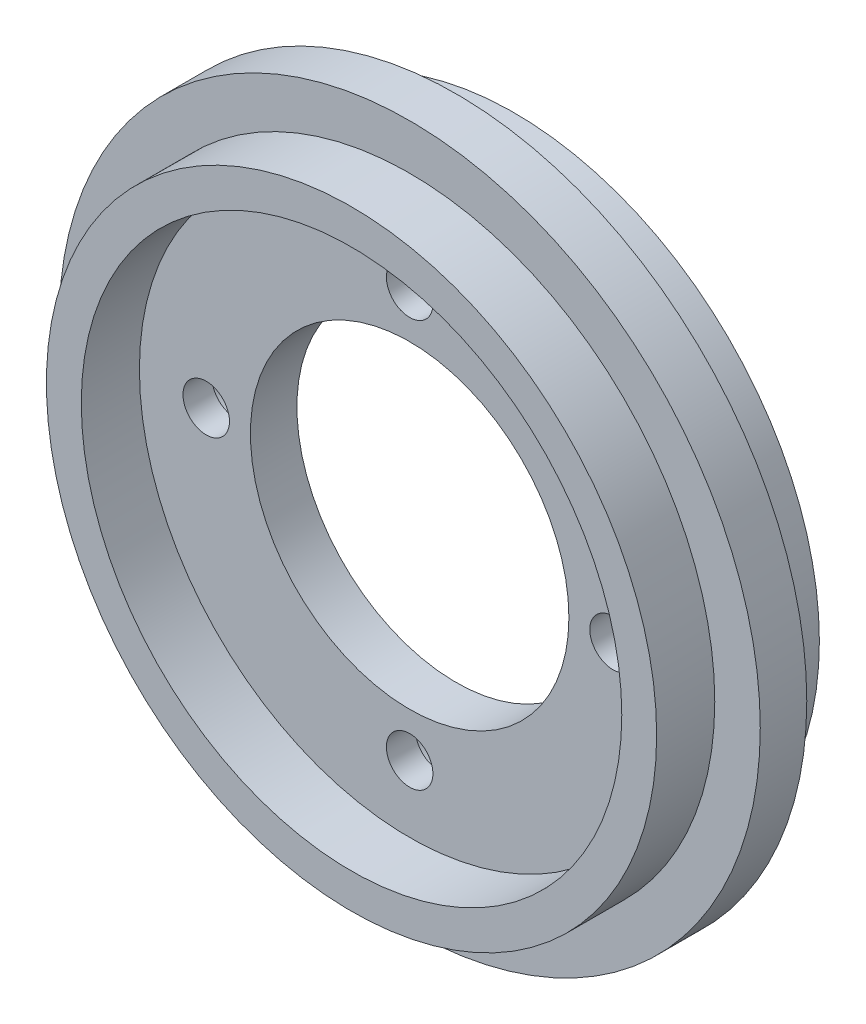
ISO-10303-21;
HEADER;
FILE_DESCRIPTION(('STEP AP214'),'2;1');
FILE_NAME('part.step','',(''),(''),'','','');
FILE_SCHEMA(('AUTOMOTIVE_DESIGN { 1 0 10303 214 1 1 1 1 }'));
ENDSEC;
DATA;
#1=APPLICATION_CONTEXT('core data for automotive mechanical design processes');
#2=APPLICATION_PROTOCOL_DEFINITION('international standard','automotive_design',2000,#1);
#3=PRODUCT_CONTEXT('',#1,'mechanical');
#4=PRODUCT('Part','Part','',(#3));
#5=PRODUCT_RELATED_PRODUCT_CATEGORY('part','',(#4));
#6=PRODUCT_DEFINITION_FORMATION('','',#4);
#7=PRODUCT_DEFINITION_CONTEXT('part definition',#1,'design');
#8=PRODUCT_DEFINITION('design','',#6,#7);
#9=PRODUCT_DEFINITION_SHAPE('','',#8);
#10=(LENGTH_UNIT() NAMED_UNIT(*) SI_UNIT(.MILLI.,.METRE.));
#11=(NAMED_UNIT(*) PLANE_ANGLE_UNIT() SI_UNIT($,.RADIAN.));
#12=(NAMED_UNIT(*) SI_UNIT($,.STERADIAN.) SOLID_ANGLE_UNIT());
#13=UNCERTAINTY_MEASURE_WITH_UNIT(LENGTH_MEASURE(1.E-05),#10,'distance_accuracy_value','');
#14=(GEOMETRIC_REPRESENTATION_CONTEXT(3) GLOBAL_UNCERTAINTY_ASSIGNED_CONTEXT((#13)) GLOBAL_UNIT_ASSIGNED_CONTEXT((#10,
#11,#12)) REPRESENTATION_CONTEXT('',''));
#15=CARTESIAN_POINT('',(0.,0.,0.));
#16=DIRECTION('',(0.,0.,1.));
#17=DIRECTION('',(1.,0.,0.));
#18=AXIS2_PLACEMENT_3D('',#15,#16,#17);
#19=CARTESIAN_POINT('',(0.,0.,-2.));
#20=DIRECTION('',(0.,0.,1.));
#21=DIRECTION('',(1.,0.,0.));
#22=AXIS2_PLACEMENT_3D('',#19,#20,#21);
#23=PLANE('',#22);
#24=CARTESIAN_POINT('',(0.,0.,-2.));
#25=DIRECTION('',(0.,0.,1.));
#26=DIRECTION('',(1.,0.,0.));
#27=AXIS2_PLACEMENT_3D('',#24,#25,#26);
#28=CIRCLE('',#27,13.7);
#29=CARTESIAN_POINT('',(13.7,0.,-2.));
#30=VERTEX_POINT('',#29);
#31=EDGE_CURVE('E51',#30,#30,#28,.T.);
#32=ORIENTED_EDGE('',*,*,#31,.T.);
#33=EDGE_LOOP('',(#32));
#34=FACE_BOUND('',#33,.T.);
#35=CARTESIAN_POINT('',(0.,-17.5,-2.));
#36=DIRECTION('',(0.,0.,-1.));
#37=DIRECTION('',(-1.,0.,0.));
#38=AXIS2_PLACEMENT_3D('',#35,#36,#37);
#39=CIRCLE('',#38,3.5);
#40=CARTESIAN_POINT('',(-3.5,-17.5,-2.));
#41=VERTEX_POINT('',#40);
#42=EDGE_CURVE('E98',#41,#41,#39,.T.);
#43=ORIENTED_EDGE('',*,*,#42,.F.);
#44=EDGE_LOOP('',(#43));
#45=FACE_BOUND('',#44,.T.);
#46=CARTESIAN_POINT('',(17.5,0.,-2.));
#47=DIRECTION('',(0.,0.,-1.));
#48=DIRECTION('',(-1.,0.,0.));
#49=AXIS2_PLACEMENT_3D('',#46,#47,#48);
#50=CIRCLE('',#49,3.5);
#51=CARTESIAN_POINT('',(14.,0.,-2.));
#52=VERTEX_POINT('',#51);
#53=EDGE_CURVE('E105',#52,#52,#50,.T.);
#54=ORIENTED_EDGE('',*,*,#53,.F.);
#55=EDGE_LOOP('',(#54));
#56=FACE_BOUND('',#55,.T.);
#57=CARTESIAN_POINT('',(-17.5,0.,-2.));
#58=DIRECTION('',(0.,0.,-1.));
#59=DIRECTION('',(-1.,0.,0.));
#60=AXIS2_PLACEMENT_3D('',#57,#58,#59);
#61=CIRCLE('',#60,3.5);
#62=CARTESIAN_POINT('',(-21.,0.,-2.));
#63=VERTEX_POINT('',#62);
#64=EDGE_CURVE('E111',#63,#63,#61,.T.);
#65=ORIENTED_EDGE('',*,*,#64,.F.);
#66=EDGE_LOOP('',(#65));
#67=FACE_BOUND('',#66,.T.);
#68=CARTESIAN_POINT('',(0.,17.5,-2.));
#69=DIRECTION('',(0.,0.,-1.));
#70=DIRECTION('',(-1.,0.,0.));
#71=AXIS2_PLACEMENT_3D('',#68,#69,#70);
#72=CIRCLE('',#71,3.5);
#73=CARTESIAN_POINT('',(-3.5,17.5,-2.));
#74=VERTEX_POINT('',#73);
#75=EDGE_CURVE('E117',#74,#74,#72,.T.);
#76=ORIENTED_EDGE('',*,*,#75,.F.);
#77=EDGE_LOOP('',(#76));
#78=FACE_BOUND('',#77,.T.);
#79=CARTESIAN_POINT('',(0.,0.,-2.));
#80=DIRECTION('',(0.,0.,1.));
#81=DIRECTION('',(1.,0.,0.));
#82=AXIS2_PLACEMENT_3D('',#79,#80,#81);
#83=CIRCLE('',#82,23.25);
#84=CARTESIAN_POINT('',(23.25,0.,-2.));
#85=VERTEX_POINT('',#84);
#86=EDGE_CURVE('E10',#85,#85,#83,.T.);
#87=ORIENTED_EDGE('',*,*,#86,.F.);
#88=EDGE_LOOP('',(#87));
#89=FACE_BOUND('',#88,.T.);
#90=ADVANCED_FACE('F35',(#34,#45,#56,#67,#78,#89),#23,.F.);
#91=CARTESIAN_POINT('',(0.,17.5,-2.));
#92=DIRECTION('',(0.,0.,1.));
#93=DIRECTION('',(1.,0.,0.));
#94=AXIS2_PLACEMENT_3D('',#91,#92,#93);
#95=CYLINDRICAL_SURFACE('',#94,2.);
#96=CARTESIAN_POINT('',(0.,17.5,2.));
#97=DIRECTION('',(0.,0.,1.));
#98=DIRECTION('',(1.,0.,0.));
#99=AXIS2_PLACEMENT_3D('',#96,#97,#98);
#100=CIRCLE('',#99,2.);
#101=CARTESIAN_POINT('',(2.,17.5,2.));
#102=VERTEX_POINT('',#101);
#103=EDGE_CURVE('E66',#102,#102,#100,.T.);
#104=ORIENTED_EDGE('',*,*,#103,.T.);
#105=EDGE_LOOP('',(#104));
#106=FACE_BOUND('',#105,.T.);
#107=CARTESIAN_POINT('',(0.,17.5,-0.5));
#108=DIRECTION('',(0.,0.,-1.));
#109=DIRECTION('',(-1.,0.,0.));
#110=AXIS2_PLACEMENT_3D('',#107,#108,#109);
#111=CIRCLE('',#110,2.);
#112=CARTESIAN_POINT('',(-2.,17.5,-0.5));
#113=VERTEX_POINT('',#112);
#114=EDGE_CURVE('E86',#113,#113,#111,.F.);
#115=ORIENTED_EDGE('',*,*,#114,.F.);
#116=EDGE_LOOP('',(#115));
#117=FACE_BOUND('',#116,.T.);
#118=ADVANCED_FACE('F143',(#106,#117),#95,.F.);
#119=CARTESIAN_POINT('',(17.5,0.,-2.));
#120=DIRECTION('',(0.,0.,1.));
#121=DIRECTION('',(1.,0.,0.));
#122=AXIS2_PLACEMENT_3D('',#119,#120,#121);
#123=CYLINDRICAL_SURFACE('',#122,2.);
#124=CARTESIAN_POINT('',(17.5,0.,2.));
#125=DIRECTION('',(0.,0.,1.));
#126=DIRECTION('',(1.,0.,0.));
#127=AXIS2_PLACEMENT_3D('',#124,#125,#126);
#128=CIRCLE('',#127,2.);
#129=CARTESIAN_POINT('',(19.5,0.,2.));
#130=VERTEX_POINT('',#129);
#131=EDGE_CURVE('E63',#130,#130,#128,.T.);
#132=ORIENTED_EDGE('',*,*,#131,.T.);
#133=EDGE_LOOP('',(#132));
#134=FACE_BOUND('',#133,.T.);
#135=CARTESIAN_POINT('',(17.5,0.,-0.5));
#136=DIRECTION('',(0.,0.,-1.));
#137=DIRECTION('',(-1.,0.,0.));
#138=AXIS2_PLACEMENT_3D('',#135,#136,#137);
#139=CIRCLE('',#138,2.);
#140=CARTESIAN_POINT('',(15.5,0.,-0.5));
#141=VERTEX_POINT('',#140);
#142=EDGE_CURVE('E84',#141,#141,#139,.F.);
#143=ORIENTED_EDGE('',*,*,#142,.F.);
#144=EDGE_LOOP('',(#143));
#145=FACE_BOUND('',#144,.T.);
#146=ADVANCED_FACE('F149',(#134,#145),#123,.F.);
#147=CARTESIAN_POINT('',(-17.5,0.,-2.));
#148=DIRECTION('',(0.,0.,1.));
#149=DIRECTION('',(1.,0.,0.));
#150=AXIS2_PLACEMENT_3D('',#147,#148,#149);
#151=CYLINDRICAL_SURFACE('',#150,2.);
#152=CARTESIAN_POINT('',(-17.5,0.,2.));
#153=DIRECTION('',(0.,0.,1.));
#154=DIRECTION('',(1.,0.,0.));
#155=AXIS2_PLACEMENT_3D('',#152,#153,#154);
#156=CIRCLE('',#155,2.);
#157=CARTESIAN_POINT('',(-15.5,0.,2.));
#158=VERTEX_POINT('',#157);
#159=EDGE_CURVE('E60',#158,#158,#156,.T.);
#160=ORIENTED_EDGE('',*,*,#159,.T.);
#161=EDGE_LOOP('',(#160));
#162=FACE_BOUND('',#161,.T.);
#163=CARTESIAN_POINT('',(-17.5,0.,-0.5));
#164=DIRECTION('',(0.,0.,-1.));
#165=DIRECTION('',(-1.,0.,0.));
#166=AXIS2_PLACEMENT_3D('',#163,#164,#165);
#167=CIRCLE('',#166,2.);
#168=CARTESIAN_POINT('',(-19.5,0.,-0.5));
#169=VERTEX_POINT('',#168);
#170=EDGE_CURVE('E80',#169,#169,#167,.F.);
#171=ORIENTED_EDGE('',*,*,#170,.F.);
#172=EDGE_LOOP('',(#171));
#173=FACE_BOUND('',#172,.T.);
#174=ADVANCED_FACE('F189',(#162,#173),#151,.F.);
#175=CARTESIAN_POINT('',(0.,-17.5,-2.));
#176=DIRECTION('',(0.,0.,1.));
#177=DIRECTION('',(1.,0.,0.));
#178=AXIS2_PLACEMENT_3D('',#175,#176,#177);
#179=CYLINDRICAL_SURFACE('',#178,2.);
#180=CARTESIAN_POINT('',(0.,-17.5,2.));
#181=DIRECTION('',(0.,0.,1.));
#182=DIRECTION('',(1.,0.,0.));
#183=AXIS2_PLACEMENT_3D('',#180,#181,#182);
#184=CIRCLE('',#183,2.);
#185=CARTESIAN_POINT('',(2.,-17.5,2.));
#186=VERTEX_POINT('',#185);
#187=EDGE_CURVE('E57',#186,#186,#184,.T.);
#188=ORIENTED_EDGE('',*,*,#187,.T.);
#189=EDGE_LOOP('',(#188));
#190=FACE_BOUND('',#189,.T.);
#191=CARTESIAN_POINT('',(0.,-17.5,-0.5));
#192=DIRECTION('',(0.,0.,-1.));
#193=DIRECTION('',(-1.,0.,0.));
#194=AXIS2_PLACEMENT_3D('',#191,#192,#193);
#195=CIRCLE('',#194,2.);
#196=CARTESIAN_POINT('',(-2.,-17.5,-0.5));
#197=VERTEX_POINT('',#196);
#198=EDGE_CURVE('E77',#197,#197,#195,.F.);
#199=ORIENTED_EDGE('',*,*,#198,.F.);
#200=EDGE_LOOP('',(#199));
#201=FACE_BOUND('',#200,.T.);
#202=ADVANCED_FACE('F184',(#190,#201),#179,.F.);
#203=CARTESIAN_POINT('',(0.,0.,2.));
#204=DIRECTION('',(0.,0.,1.));
#205=DIRECTION('',(1.,0.,0.));
#206=AXIS2_PLACEMENT_3D('',#203,#204,#205);
#207=PLANE('',#206);
#208=ORIENTED_EDGE('',*,*,#187,.F.);
#209=EDGE_LOOP('',(#208));
#210=FACE_BOUND('',#209,.T.);
#211=ORIENTED_EDGE('',*,*,#131,.F.);
#212=EDGE_LOOP('',(#211));
#213=FACE_BOUND('',#212,.T.);
#214=CARTESIAN_POINT('',(0.,0.,2.));
#215=DIRECTION('',(0.,0.,1.));
#216=DIRECTION('',(1.,0.,0.));
#217=AXIS2_PLACEMENT_3D('',#214,#215,#216);
#218=CIRCLE('',#217,13.7);
#219=CARTESIAN_POINT('',(13.7,0.,2.));
#220=VERTEX_POINT('',#219);
#221=EDGE_CURVE('E69',#220,#220,#218,.T.);
#222=ORIENTED_EDGE('',*,*,#221,.F.);
#223=EDGE_LOOP('',(#222));
#224=FACE_BOUND('',#223,.T.);
#225=ORIENTED_EDGE('',*,*,#103,.F.);
#226=EDGE_LOOP('',(#225));
#227=FACE_BOUND('',#226,.T.);
#228=ORIENTED_EDGE('',*,*,#159,.F.);
#229=EDGE_LOOP('',(#228));
#230=FACE_BOUND('',#229,.T.);
#231=CARTESIAN_POINT('',(0.,0.,2.));
#232=DIRECTION('',(0.,0.,1.));
#233=DIRECTION('',(1.,0.,0.));
#234=AXIS2_PLACEMENT_3D('',#231,#232,#233);
#235=CIRCLE('',#234,23.25);
#236=CARTESIAN_POINT('',(23.25,0.,2.));
#237=VERTEX_POINT('',#236);
#238=EDGE_CURVE('E88',#237,#237,#235,.T.);
#239=ORIENTED_EDGE('',*,*,#238,.T.);
#240=EDGE_LOOP('',(#239));
#241=FACE_BOUND('',#240,.T.);
#242=ADVANCED_FACE('F163',(#210,#213,#224,#227,#230,#241),#207,.T.);
#243=CARTESIAN_POINT('',(0.,0.,-2.));
#244=DIRECTION('',(0.,0.,1.));
#245=DIRECTION('',(1.,0.,0.));
#246=AXIS2_PLACEMENT_3D('',#243,#244,#245);
#247=CYLINDRICAL_SURFACE('',#246,30.165);
#248=CARTESIAN_POINT('',(0.,0.,-2.));
#249=DIRECTION('',(0.,0.,1.));
#250=DIRECTION('',(1.,0.,0.));
#251=AXIS2_PLACEMENT_3D('',#248,#249,#250);
#252=CIRCLE('',#251,30.165);
#253=CARTESIAN_POINT('',(30.165,0.,-2.));
#254=VERTEX_POINT('',#253);
#255=EDGE_CURVE('E46',#254,#254,#252,.T.);
#256=ORIENTED_EDGE('',*,*,#255,.T.);
#257=EDGE_LOOP('',(#256));
#258=FACE_BOUND('',#257,.T.);
#259=CARTESIAN_POINT('',(0.,0.,2.));
#260=DIRECTION('',(0.,0.,1.));
#261=DIRECTION('',(1.,0.,0.));
#262=AXIS2_PLACEMENT_3D('',#259,#260,#261);
#263=CIRCLE('',#262,30.165);
#264=CARTESIAN_POINT('',(30.165,0.,2.));
#265=VERTEX_POINT('',#264);
#266=EDGE_CURVE('E72',#265,#265,#263,.T.);
#267=ORIENTED_EDGE('',*,*,#266,.F.);
#268=EDGE_LOOP('',(#267));
#269=FACE_BOUND('',#268,.T.);
#270=ADVANCED_FACE('F37',(#258,#269),#247,.T.);
#271=CARTESIAN_POINT('',(0.,0.,-2.));
#272=DIRECTION('',(0.,0.,1.));
#273=DIRECTION('',(1.,0.,0.));
#274=AXIS2_PLACEMENT_3D('',#271,#272,#273);
#275=CIRCLE('',#274,26.25);
#276=CARTESIAN_POINT('',(26.25,0.,-2.));
#277=VERTEX_POINT('',#276);
#278=EDGE_CURVE('E122',#277,#277,#275,.T.);
#279=ORIENTED_EDGE('',*,*,#278,.T.);
#280=EDGE_LOOP('',(#279));
#281=FACE_BOUND('',#280,.T.);
#282=ORIENTED_EDGE('',*,*,#255,.F.);
#283=EDGE_LOOP('',(#282));
#284=FACE_BOUND('',#283,.T.);
#285=ADVANCED_FACE('F145',(#281,#284),#23,.F.);
#286=CARTESIAN_POINT('',(0.,0.,-2.));
#287=DIRECTION('',(0.,0.,1.));
#288=DIRECTION('',(1.,0.,0.));
#289=AXIS2_PLACEMENT_3D('',#286,#287,#288);
#290=CYLINDRICAL_SURFACE('',#289,13.7);
#291=ORIENTED_EDGE('',*,*,#31,.F.);
#292=EDGE_LOOP('',(#291));
#293=FACE_BOUND('',#292,.T.);
#294=ORIENTED_EDGE('',*,*,#221,.T.);
#295=EDGE_LOOP('',(#294));
#296=FACE_BOUND('',#295,.T.);
#297=ADVANCED_FACE('F155',(#293,#296),#290,.F.);
#298=CARTESIAN_POINT('',(0.,0.,2.));
#299=DIRECTION('',(0.,0.,1.));
#300=DIRECTION('',(1.,0.,0.));
#301=AXIS2_PLACEMENT_3D('',#298,#299,#300);
#302=CIRCLE('',#301,26.25);
#303=CARTESIAN_POINT('',(26.25,0.,2.));
#304=VERTEX_POINT('',#303);
#305=EDGE_CURVE('E42',#304,#304,#302,.T.);
#306=ORIENTED_EDGE('',*,*,#305,.F.);
#307=EDGE_LOOP('',(#306));
#308=FACE_BOUND('',#307,.T.);
#309=ORIENTED_EDGE('',*,*,#266,.T.);
#310=EDGE_LOOP('',(#309));
#311=FACE_BOUND('',#310,.T.);
#312=ADVANCED_FACE('F161',(#308,#311),#207,.T.);
#313=CARTESIAN_POINT('',(0.,0.,7.));
#314=DIRECTION('',(0.,0.,1.));
#315=DIRECTION('',(1.,0.,0.));
#316=AXIS2_PLACEMENT_3D('',#313,#314,#315);
#317=PLANE('',#316);
#318=CARTESIAN_POINT('',(0.,0.,7.));
#319=DIRECTION('',(0.,0.,1.));
#320=DIRECTION('',(1.,0.,0.));
#321=AXIS2_PLACEMENT_3D('',#318,#319,#320);
#322=CIRCLE('',#321,26.25);
#323=CARTESIAN_POINT('',(26.25,0.,7.));
#324=VERTEX_POINT('',#323);
#325=EDGE_CURVE('E55',#324,#324,#322,.T.);
#326=ORIENTED_EDGE('',*,*,#325,.T.);
#327=EDGE_LOOP('',(#326));
#328=FACE_BOUND('',#327,.T.);
#329=CARTESIAN_POINT('',(0.,0.,7.));
#330=DIRECTION('',(0.,0.,1.));
#331=DIRECTION('',(1.,0.,0.));
#332=AXIS2_PLACEMENT_3D('',#329,#330,#331);
#333=CIRCLE('',#332,23.25);
#334=CARTESIAN_POINT('',(23.25,0.,7.));
#335=VERTEX_POINT('',#334);
#336=EDGE_CURVE('E92',#335,#335,#333,.T.);
#337=ORIENTED_EDGE('',*,*,#336,.F.);
#338=EDGE_LOOP('',(#337));
#339=FACE_BOUND('',#338,.T.);
#340=ADVANCED_FACE('F172',(#328,#339),#317,.T.);
#341=CARTESIAN_POINT('',(0.,0.,7.));
#342=DIRECTION('',(0.,0.,-1.));
#343=DIRECTION('',(-1.,0.,0.));
#344=AXIS2_PLACEMENT_3D('',#341,#342,#343);
#345=CYLINDRICAL_SURFACE('',#344,26.25);
#346=ORIENTED_EDGE('',*,*,#325,.F.);
#347=EDGE_LOOP('',(#346));
#348=FACE_BOUND('',#347,.T.);
#349=ORIENTED_EDGE('',*,*,#305,.T.);
#350=EDGE_LOOP('',(#349));
#351=FACE_BOUND('',#350,.T.);
#352=ADVANCED_FACE('F178',(#348,#351),#345,.T.);
#353=CARTESIAN_POINT('',(0.,0.,7.));
#354=DIRECTION('',(0.,0.,-1.));
#355=DIRECTION('',(-1.,0.,0.));
#356=AXIS2_PLACEMENT_3D('',#353,#354,#355);
#357=CYLINDRICAL_SURFACE('',#356,23.25);
#358=ORIENTED_EDGE('',*,*,#336,.T.);
#359=EDGE_LOOP('',(#358));
#360=FACE_BOUND('',#359,.T.);
#361=ORIENTED_EDGE('',*,*,#238,.F.);
#362=EDGE_LOOP('',(#361));
#363=FACE_BOUND('',#362,.T.);
#364=ADVANCED_FACE('F235',(#360,#363),#357,.F.);
#365=CARTESIAN_POINT('',(0.,-17.5,-0.5));
#366=DIRECTION('',(0.,0.,-1.));
#367=DIRECTION('',(-1.,0.,0.));
#368=AXIS2_PLACEMENT_3D('',#365,#366,#367);
#369=PLANE('',#368);
#370=CARTESIAN_POINT('',(0.,-17.5,-0.5));
#371=DIRECTION('',(0.,0.,-1.));
#372=DIRECTION('',(-1.,0.,0.));
#373=AXIS2_PLACEMENT_3D('',#370,#371,#372);
#374=CIRCLE('',#373,3.5);
#375=CARTESIAN_POINT('',(-3.5,-17.5,-0.5));
#376=VERTEX_POINT('',#375);
#377=EDGE_CURVE('E101',#376,#376,#374,.T.);
#378=ORIENTED_EDGE('',*,*,#377,.T.);
#379=EDGE_LOOP('',(#378));
#380=FACE_BOUND('',#379,.T.);
#381=ORIENTED_EDGE('',*,*,#198,.T.);
#382=EDGE_LOOP('',(#381));
#383=FACE_BOUND('',#382,.T.);
#384=ADVANCED_FACE('F219',(#380,#383),#369,.T.);
#385=CARTESIAN_POINT('',(0.,-17.5,-0.5));
#386=DIRECTION('',(0.,0.,-1.));
#387=DIRECTION('',(-1.,0.,0.));
#388=AXIS2_PLACEMENT_3D('',#385,#386,#387);
#389=CYLINDRICAL_SURFACE('',#388,3.5);
#390=ORIENTED_EDGE('',*,*,#377,.F.);
#391=EDGE_LOOP('',(#390));
#392=FACE_BOUND('',#391,.T.);
#393=ORIENTED_EDGE('',*,*,#42,.T.);
#394=EDGE_LOOP('',(#393));
#395=FACE_BOUND('',#394,.T.);
#396=ADVANCED_FACE('F209',(#392,#395),#389,.F.);
#397=CARTESIAN_POINT('',(-17.5,0.,-0.5));
#398=DIRECTION('',(0.,0.,-1.));
#399=DIRECTION('',(-1.,0.,0.));
#400=AXIS2_PLACEMENT_3D('',#397,#398,#399);
#401=PLANE('',#400);
#402=CARTESIAN_POINT('',(-17.5,0.,-0.5));
#403=DIRECTION('',(0.,0.,-1.));
#404=DIRECTION('',(-1.,0.,0.));
#405=AXIS2_PLACEMENT_3D('',#402,#403,#404);
#406=CIRCLE('',#405,3.5);
#407=CARTESIAN_POINT('',(-21.,0.,-0.5));
#408=VERTEX_POINT('',#407);
#409=EDGE_CURVE('E114',#408,#408,#406,.T.);
#410=ORIENTED_EDGE('',*,*,#409,.T.);
#411=EDGE_LOOP('',(#410));
#412=FACE_BOUND('',#411,.T.);
#413=ORIENTED_EDGE('',*,*,#170,.T.);
#414=EDGE_LOOP('',(#413));
#415=FACE_BOUND('',#414,.T.);
#416=ADVANCED_FACE('F206',(#412,#415),#401,.T.);
#417=CARTESIAN_POINT('',(-17.5,0.,-0.5));
#418=DIRECTION('',(0.,0.,-1.));
#419=DIRECTION('',(-1.,0.,0.));
#420=AXIS2_PLACEMENT_3D('',#417,#418,#419);
#421=CYLINDRICAL_SURFACE('',#420,3.5);
#422=ORIENTED_EDGE('',*,*,#409,.F.);
#423=EDGE_LOOP('',(#422));
#424=FACE_BOUND('',#423,.T.);
#425=ORIENTED_EDGE('',*,*,#64,.T.);
#426=EDGE_LOOP('',(#425));
#427=FACE_BOUND('',#426,.T.);
#428=ADVANCED_FACE('F208',(#424,#427),#421,.F.);
#429=CARTESIAN_POINT('',(17.5,0.,-0.5));
#430=DIRECTION('',(0.,0.,-1.));
#431=DIRECTION('',(-1.,0.,0.));
#432=AXIS2_PLACEMENT_3D('',#429,#430,#431);
#433=PLANE('',#432);
#434=CARTESIAN_POINT('',(17.5,0.,-0.5));
#435=DIRECTION('',(0.,0.,-1.));
#436=DIRECTION('',(-1.,0.,0.));
#437=AXIS2_PLACEMENT_3D('',#434,#435,#436);
#438=CIRCLE('',#437,3.5);
#439=CARTESIAN_POINT('',(14.,0.,-0.5));
#440=VERTEX_POINT('',#439);
#441=EDGE_CURVE('E108',#440,#440,#438,.T.);
#442=ORIENTED_EDGE('',*,*,#441,.T.);
#443=EDGE_LOOP('',(#442));
#444=FACE_BOUND('',#443,.T.);
#445=ORIENTED_EDGE('',*,*,#142,.T.);
#446=EDGE_LOOP('',(#445));
#447=FACE_BOUND('',#446,.T.);
#448=ADVANCED_FACE('F216',(#444,#447),#433,.T.);
#449=CARTESIAN_POINT('',(17.5,0.,-0.5));
#450=DIRECTION('',(0.,0.,-1.));
#451=DIRECTION('',(-1.,0.,0.));
#452=AXIS2_PLACEMENT_3D('',#449,#450,#451);
#453=CYLINDRICAL_SURFACE('',#452,3.5);
#454=ORIENTED_EDGE('',*,*,#441,.F.);
#455=EDGE_LOOP('',(#454));
#456=FACE_BOUND('',#455,.T.);
#457=ORIENTED_EDGE('',*,*,#53,.T.);
#458=EDGE_LOOP('',(#457));
#459=FACE_BOUND('',#458,.T.);
#460=ADVANCED_FACE('F228',(#456,#459),#453,.F.);
#461=CARTESIAN_POINT('',(0.,17.5,-0.5));
#462=DIRECTION('',(0.,0.,-1.));
#463=DIRECTION('',(-1.,0.,0.));
#464=AXIS2_PLACEMENT_3D('',#461,#462,#463);
#465=PLANE('',#464);
#466=CARTESIAN_POINT('',(0.,17.5,-0.5));
#467=DIRECTION('',(0.,0.,-1.));
#468=DIRECTION('',(-1.,0.,0.));
#469=AXIS2_PLACEMENT_3D('',#466,#467,#468);
#470=CIRCLE('',#469,3.5);
#471=CARTESIAN_POINT('',(-3.5,17.5,-0.5));
#472=VERTEX_POINT('',#471);
#473=EDGE_CURVE('E81',#472,#472,#470,.T.);
#474=ORIENTED_EDGE('',*,*,#473,.T.);
#475=EDGE_LOOP('',(#474));
#476=FACE_BOUND('',#475,.T.);
#477=ORIENTED_EDGE('',*,*,#114,.T.);
#478=EDGE_LOOP('',(#477));
#479=FACE_BOUND('',#478,.T.);
#480=ADVANCED_FACE('F232',(#476,#479),#465,.T.);
#481=CARTESIAN_POINT('',(0.,17.5,-0.5));
#482=DIRECTION('',(0.,0.,-1.));
#483=DIRECTION('',(-1.,0.,0.));
#484=AXIS2_PLACEMENT_3D('',#481,#482,#483);
#485=CYLINDRICAL_SURFACE('',#484,3.5);
#486=ORIENTED_EDGE('',*,*,#473,.F.);
#487=EDGE_LOOP('',(#486));
#488=FACE_BOUND('',#487,.T.);
#489=ORIENTED_EDGE('',*,*,#75,.T.);
#490=EDGE_LOOP('',(#489));
#491=FACE_BOUND('',#490,.T.);
#492=ADVANCED_FACE('F223',(#488,#491),#485,.F.);
#493=CARTESIAN_POINT('',(0.,0.,-7.));
#494=DIRECTION('',(0.,0.,1.));
#495=DIRECTION('',(1.,0.,0.));
#496=AXIS2_PLACEMENT_3D('',#493,#494,#495);
#497=CYLINDRICAL_SURFACE('',#496,26.25);
#498=CARTESIAN_POINT('',(0.,0.,-7.));
#499=DIRECTION('',(0.,0.,1.));
#500=DIRECTION('',(1.,0.,0.));
#501=AXIS2_PLACEMENT_3D('',#498,#499,#500);
#502=CIRCLE('',#501,26.25);
#503=CARTESIAN_POINT('',(26.25,0.,-7.));
#504=VERTEX_POINT('',#503);
#505=EDGE_CURVE('E102',#504,#504,#502,.T.);
#506=ORIENTED_EDGE('',*,*,#505,.T.);
#507=EDGE_LOOP('',(#506));
#508=FACE_BOUND('',#507,.T.);
#509=ORIENTED_EDGE('',*,*,#278,.F.);
#510=EDGE_LOOP('',(#509));
#511=FACE_BOUND('',#510,.T.);
#512=ADVANCED_FACE('F140',(#508,#511),#497,.T.);
#513=CARTESIAN_POINT('',(0.,0.,-7.));
#514=DIRECTION('',(0.,0.,-1.));
#515=DIRECTION('',(1.,0.,0.));
#516=AXIS2_PLACEMENT_3D('',#513,#514,#515);
#517=PLANE('',#516);
#518=CARTESIAN_POINT('',(0.,0.,-7.));
#519=DIRECTION('',(0.,0.,1.));
#520=DIRECTION('',(1.,0.,0.));
#521=AXIS2_PLACEMENT_3D('',#518,#519,#520);
#522=CIRCLE('',#521,23.25);
#523=CARTESIAN_POINT('',(23.25,0.,-7.));
#524=VERTEX_POINT('',#523);
#525=EDGE_CURVE('E125',#524,#524,#522,.T.);
#526=ORIENTED_EDGE('',*,*,#525,.T.);
#527=EDGE_LOOP('',(#526));
#528=FACE_BOUND('',#527,.T.);
#529=ORIENTED_EDGE('',*,*,#505,.F.);
#530=EDGE_LOOP('',(#529));
#531=FACE_BOUND('',#530,.T.);
#532=ADVANCED_FACE('F131',(#528,#531),#517,.T.);
#533=CARTESIAN_POINT('',(0.,0.,-7.));
#534=DIRECTION('',(0.,0.,1.));
#535=DIRECTION('',(1.,0.,0.));
#536=AXIS2_PLACEMENT_3D('',#533,#534,#535);
#537=CYLINDRICAL_SURFACE('',#536,23.25);
#538=ORIENTED_EDGE('',*,*,#525,.F.);
#539=EDGE_LOOP('',(#538));
#540=FACE_BOUND('',#539,.T.);
#541=ORIENTED_EDGE('',*,*,#86,.T.);
#542=EDGE_LOOP('',(#541));
#543=FACE_BOUND('',#542,.T.);
#544=ADVANCED_FACE('F134',(#540,#543),#537,.F.);
#545=CLOSED_SHELL('',(#90,#118,#146,#174,#202,#242,#270,#285,#297,#312,#340,#352,#364,#384,#396,
#416,#428,#448,#460,#480,#492,#512,#532,#544));
#546=MANIFOLD_SOLID_BREP('B2',#545);
#547=ADVANCED_BREP_SHAPE_REPRESENTATION('',(#18,#546),#14);
#548=SHAPE_DEFINITION_REPRESENTATION(#9,#547);
ENDSEC;
END-ISO-10303-21;
